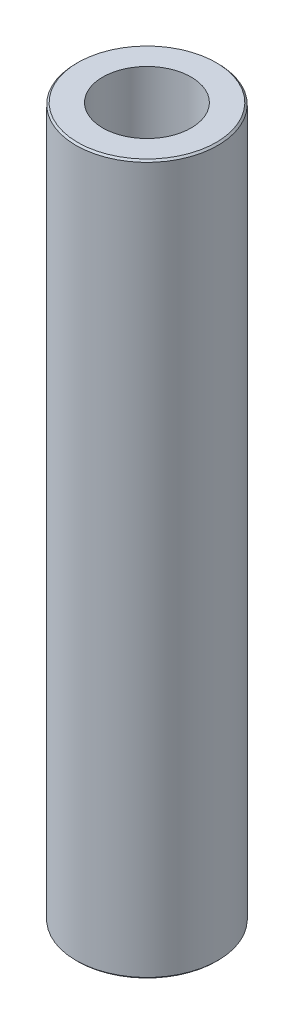
ISO-10303-21;
HEADER;
FILE_DESCRIPTION(('STEP AP214'),'2;1');
FILE_NAME('part.step','',(''),(''),'','','');
FILE_SCHEMA(('AUTOMOTIVE_DESIGN { 1 0 10303 214 1 1 1 1 }'));
ENDSEC;
DATA;
#1=APPLICATION_CONTEXT('core data for automotive mechanical design processes');
#2=APPLICATION_PROTOCOL_DEFINITION('international standard','automotive_design',2000,#1);
#3=PRODUCT_CONTEXT('',#1,'mechanical');
#4=PRODUCT('Part','Part','',(#3));
#5=PRODUCT_RELATED_PRODUCT_CATEGORY('part','',(#4));
#6=PRODUCT_DEFINITION_FORMATION('','',#4);
#7=PRODUCT_DEFINITION_CONTEXT('part definition',#1,'design');
#8=PRODUCT_DEFINITION('design','',#6,#7);
#9=PRODUCT_DEFINITION_SHAPE('','',#8);
#10=(LENGTH_UNIT() NAMED_UNIT(*) SI_UNIT(.MILLI.,.METRE.));
#11=(NAMED_UNIT(*) PLANE_ANGLE_UNIT() SI_UNIT($,.RADIAN.));
#12=(NAMED_UNIT(*) SI_UNIT($,.STERADIAN.) SOLID_ANGLE_UNIT());
#13=UNCERTAINTY_MEASURE_WITH_UNIT(LENGTH_MEASURE(1.E-05),#10,'distance_accuracy_value','');
#14=(GEOMETRIC_REPRESENTATION_CONTEXT(3) GLOBAL_UNCERTAINTY_ASSIGNED_CONTEXT((#13)) GLOBAL_UNIT_ASSIGNED_CONTEXT((#10,
#11,#12)) REPRESENTATION_CONTEXT('',''));
#15=CARTESIAN_POINT('',(0.,0.,0.));
#16=DIRECTION('',(0.,0.,1.));
#17=DIRECTION('',(1.,0.,0.));
#18=AXIS2_PLACEMENT_3D('',#15,#16,#17);
#19=CARTESIAN_POINT('',(0.,600.,0.));
#20=DIRECTION('',(0.,-1.,0.));
#21=DIRECTION('',(0.,0.,-1.));
#22=AXIS2_PLACEMENT_3D('',#19,#20,#21);
#23=CYLINDRICAL_SURFACE('',#22,60.);
#24=CARTESIAN_POINT('',(0.,598.54891063369,0.));
#25=DIRECTION('',(0.,1.,0.));
#26=DIRECTION('',(0.,0.,1.));
#27=AXIS2_PLACEMENT_3D('',#24,#25,#26);
#28=CIRCLE('',#27,60.);
#29=CARTESIAN_POINT('',(0.,598.54891063369,60.));
#30=VERTEX_POINT('',#29);
#31=EDGE_CURVE('E50',#30,#30,#28,.F.);
#32=ORIENTED_EDGE('',*,*,#31,.T.);
#33=EDGE_LOOP('',(#32));
#34=FACE_BOUND('',#33,.T.);
#35=CARTESIAN_POINT('',(0.,1.45108936631033,0.));
#36=DIRECTION('',(0.,1.,0.));
#37=DIRECTION('',(0.,0.,1.));
#38=AXIS2_PLACEMENT_3D('',#35,#36,#37);
#39=CIRCLE('',#38,60.);
#40=CARTESIAN_POINT('',(0.,1.45108936631033,60.));
#41=VERTEX_POINT('',#40);
#42=EDGE_CURVE('E51',#41,#41,#39,.T.);
#43=ORIENTED_EDGE('',*,*,#42,.T.);
#44=EDGE_LOOP('',(#43));
#45=FACE_BOUND('',#44,.T.);
#46=ADVANCED_FACE('F39',(#34,#45),#23,.T.);
#47=CARTESIAN_POINT('',(0.,600.,0.));
#48=DIRECTION('',(0.,1.,0.));
#49=DIRECTION('',(0.,0.,1.));
#50=AXIS2_PLACEMENT_3D('',#47,#48,#49);
#51=PLANE('',#50);
#52=CARTESIAN_POINT('',(0.,600.,0.));
#53=DIRECTION('',(0.,1.,0.));
#54=DIRECTION('',(0.,0.,1.));
#55=AXIS2_PLACEMENT_3D('',#52,#53,#54);
#56=CIRCLE('',#55,58.5489106336895);
#57=CARTESIAN_POINT('',(0.,600.,58.5489106336895));
#58=VERTEX_POINT('',#57);
#59=EDGE_CURVE('E54',#58,#58,#56,.T.);
#60=ORIENTED_EDGE('',*,*,#59,.T.);
#61=EDGE_LOOP('',(#60));
#62=FACE_BOUND('',#61,.T.);
#63=CARTESIAN_POINT('',(0.,600.,0.));
#64=DIRECTION('',(0.,1.,0.));
#65=DIRECTION('',(0.,0.,1.));
#66=AXIS2_PLACEMENT_3D('',#63,#64,#65);
#67=CIRCLE('',#66,37.3742239672261);
#68=CARTESIAN_POINT('',(0.,600.,37.3742239672261));
#69=VERTEX_POINT('',#68);
#70=EDGE_CURVE('E58',#69,#69,#67,.T.);
#71=ORIENTED_EDGE('',*,*,#70,.F.);
#72=EDGE_LOOP('',(#71));
#73=FACE_BOUND('',#72,.T.);
#74=ADVANCED_FACE('F69',(#62,#73),#51,.T.);
#75=CARTESIAN_POINT('',(0.,0.,0.));
#76=DIRECTION('',(0.,1.,0.));
#77=DIRECTION('',(0.,0.,1.));
#78=AXIS2_PLACEMENT_3D('',#75,#76,#77);
#79=PLANE('',#78);
#80=CARTESIAN_POINT('',(0.,0.,0.));
#81=DIRECTION('',(0.,1.,0.));
#82=DIRECTION('',(0.,0.,1.));
#83=AXIS2_PLACEMENT_3D('',#80,#81,#82);
#84=CIRCLE('',#83,58.5489106336897);
#85=CARTESIAN_POINT('',(0.,0.,58.5489106336897));
#86=VERTEX_POINT('',#85);
#87=EDGE_CURVE('E10',#86,#86,#84,.F.);
#88=ORIENTED_EDGE('',*,*,#87,.T.);
#89=EDGE_LOOP('',(#88));
#90=FACE_BOUND('',#89,.T.);
#91=CARTESIAN_POINT('',(0.,0.,0.));
#92=DIRECTION('',(0.,1.,0.));
#93=DIRECTION('',(0.,0.,1.));
#94=AXIS2_PLACEMENT_3D('',#91,#92,#93);
#95=CIRCLE('',#94,37.3742239672261);
#96=CARTESIAN_POINT('',(0.,0.,37.3742239672261));
#97=VERTEX_POINT('',#96);
#98=EDGE_CURVE('E63',#97,#97,#95,.T.);
#99=ORIENTED_EDGE('',*,*,#98,.T.);
#100=EDGE_LOOP('',(#99));
#101=FACE_BOUND('',#100,.T.);
#102=ADVANCED_FACE('F75',(#90,#101),#79,.F.);
#103=CARTESIAN_POINT('',(0.,600.,0.));
#104=DIRECTION('',(0.,-1.,0.));
#105=DIRECTION('',(0.,0.,-1.));
#106=AXIS2_PLACEMENT_3D('',#103,#104,#105);
#107=CYLINDRICAL_SURFACE('',#106,37.3742239672261);
#108=ORIENTED_EDGE('',*,*,#70,.T.);
#109=EDGE_LOOP('',(#108));
#110=FACE_BOUND('',#109,.T.);
#111=ORIENTED_EDGE('',*,*,#98,.F.);
#112=EDGE_LOOP('',(#111));
#113=FACE_BOUND('',#112,.T.);
#114=ADVANCED_FACE('F70',(#110,#113),#107,.F.);
#115=CARTESIAN_POINT('',(0.,600.,0.));
#116=DIRECTION('',(0.,-1.,0.));
#117=DIRECTION('',(0.,0.,-1.));
#118=AXIS2_PLACEMENT_3D('',#115,#116,#117);
#119=CONICAL_SURFACE('',#118,58.5489106336895,0.785398163397467);
#120=ORIENTED_EDGE('',*,*,#31,.F.);
#121=EDGE_LOOP('',(#120));
#122=FACE_BOUND('',#121,.T.);
#123=ORIENTED_EDGE('',*,*,#59,.F.);
#124=EDGE_LOOP('',(#123));
#125=FACE_BOUND('',#124,.T.);
#126=ADVANCED_FACE('F81',(#122,#125),#119,.T.);
#127=CARTESIAN_POINT('',(0.,1.45108936631033,0.));
#128=DIRECTION('',(0.,1.,0.));
#129=DIRECTION('',(0.,0.,1.));
#130=AXIS2_PLACEMENT_3D('',#127,#128,#129);
#131=CONICAL_SURFACE('',#130,60.,0.785398163397429);
#132=ORIENTED_EDGE('',*,*,#87,.F.);
#133=EDGE_LOOP('',(#132));
#134=FACE_BOUND('',#133,.T.);
#135=ORIENTED_EDGE('',*,*,#42,.F.);
#136=EDGE_LOOP('',(#135));
#137=FACE_BOUND('',#136,.T.);
#138=ADVANCED_FACE('F45',(#134,#137),#131,.T.);
#139=CLOSED_SHELL('',(#46,#74,#102,#114,#126,#138));
#140=MANIFOLD_SOLID_BREP('B2',#139);
#141=ADVANCED_BREP_SHAPE_REPRESENTATION('',(#18,#140),#14);
#142=SHAPE_DEFINITION_REPRESENTATION(#9,#141);
ENDSEC;
END-ISO-10303-21;
